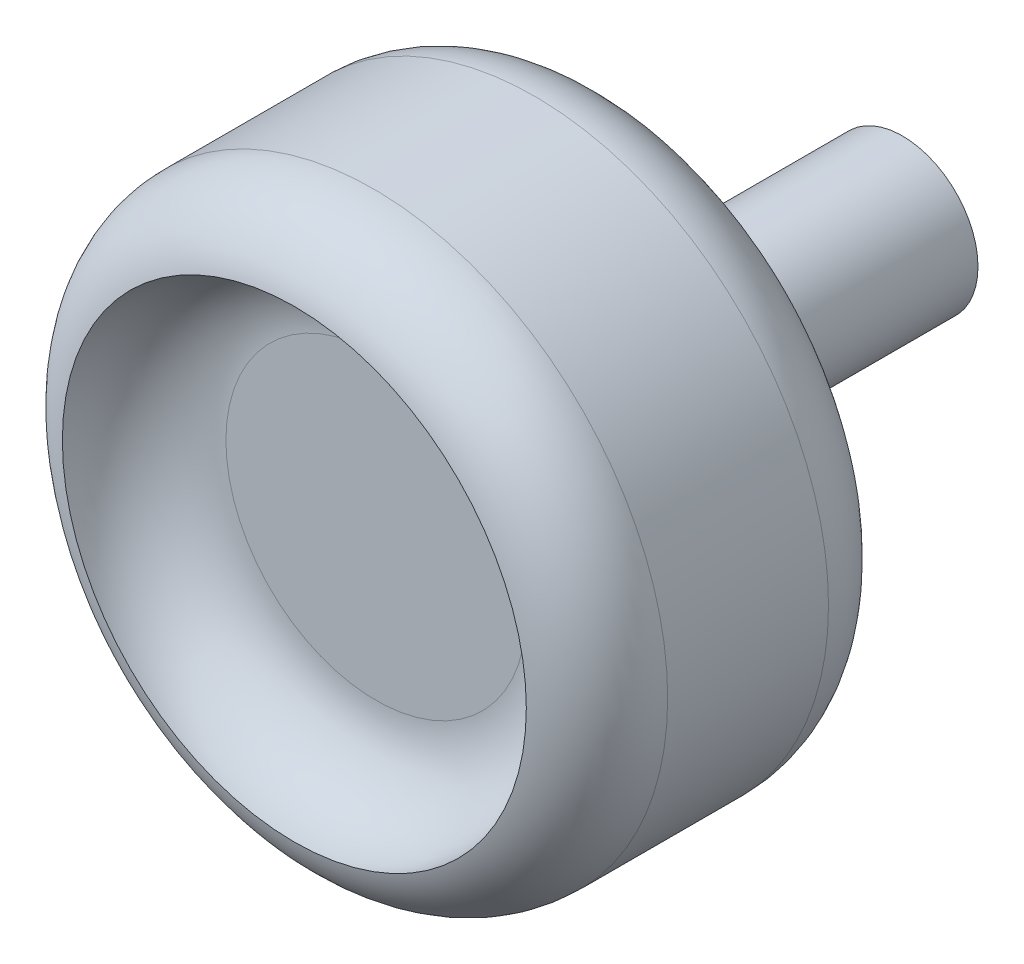
ISO-10303-21;
HEADER;
FILE_DESCRIPTION(('STEP AP214'),'2;1');
FILE_NAME('part.step','',(''),(''),'','','');
FILE_SCHEMA(('AUTOMOTIVE_DESIGN { 1 0 10303 214 1 1 1 1 }'));
ENDSEC;
DATA;
#1=APPLICATION_CONTEXT('core data for automotive mechanical design processes');
#2=APPLICATION_PROTOCOL_DEFINITION('international standard','automotive_design',2000,#1);
#3=PRODUCT_CONTEXT('',#1,'mechanical');
#4=PRODUCT('Part','Part','',(#3));
#5=PRODUCT_RELATED_PRODUCT_CATEGORY('part','',(#4));
#6=PRODUCT_DEFINITION_FORMATION('','',#4);
#7=PRODUCT_DEFINITION_CONTEXT('part definition',#1,'design');
#8=PRODUCT_DEFINITION('design','',#6,#7);
#9=PRODUCT_DEFINITION_SHAPE('','',#8);
#10=(LENGTH_UNIT() NAMED_UNIT(*) SI_UNIT(.MILLI.,.METRE.));
#11=(NAMED_UNIT(*) PLANE_ANGLE_UNIT() SI_UNIT($,.RADIAN.));
#12=(NAMED_UNIT(*) SI_UNIT($,.STERADIAN.) SOLID_ANGLE_UNIT());
#13=UNCERTAINTY_MEASURE_WITH_UNIT(LENGTH_MEASURE(1.E-05),#10,'distance_accuracy_value','');
#14=(GEOMETRIC_REPRESENTATION_CONTEXT(3) GLOBAL_UNCERTAINTY_ASSIGNED_CONTEXT((#13)) GLOBAL_UNIT_ASSIGNED_CONTEXT((#10,
#11,#12)) REPRESENTATION_CONTEXT('',''));
#15=CARTESIAN_POINT('',(0.,0.,0.));
#16=DIRECTION('',(0.,0.,1.));
#17=DIRECTION('',(1.,0.,0.));
#18=AXIS2_PLACEMENT_3D('',#15,#16,#17);
#19=CARTESIAN_POINT('',(21.7507776035779,-13.8367406859206,8.89));
#20=DIRECTION('',(0.,0.,-1.));
#21=DIRECTION('',(-1.,0.,0.));
#22=AXIS2_PLACEMENT_3D('',#19,#20,#21);
#23=CYLINDRICAL_SURFACE('',#22,2.34536814916272);
#24=CARTESIAN_POINT('',(21.7507776035779,-13.8367406859206,8.89));
#25=DIRECTION('',(0.,0.,1.));
#26=DIRECTION('',(1.,0.,0.));
#27=AXIS2_PLACEMENT_3D('',#24,#25,#26);
#28=CIRCLE('',#27,2.34536814916272);
#29=CARTESIAN_POINT('',(24.0961457527406,-13.8367406859206,8.89));
#30=VERTEX_POINT('',#29);
#31=EDGE_CURVE('E50',#30,#30,#28,.T.);
#32=ORIENTED_EDGE('',*,*,#31,.F.);
#33=EDGE_LOOP('',(#32));
#34=FACE_BOUND('',#33,.T.);
#35=CARTESIAN_POINT('',(21.7507776035779,-13.8367406859206,0.));
#36=DIRECTION('',(0.,0.,1.));
#37=DIRECTION('',(1.,0.,0.));
#38=AXIS2_PLACEMENT_3D('',#35,#36,#37);
#39=CIRCLE('',#38,2.34536814916272);
#40=CARTESIAN_POINT('',(24.0961457527406,-13.8367406859206,0.));
#41=VERTEX_POINT('',#40);
#42=EDGE_CURVE('E51',#41,#41,#39,.T.);
#43=ORIENTED_EDGE('',*,*,#42,.T.);
#44=EDGE_LOOP('',(#43));
#45=FACE_BOUND('',#44,.T.);
#46=ADVANCED_FACE('F30',(#34,#45),#23,.T.);
#47=CARTESIAN_POINT('',(21.7507776035779,-13.8367406859206,0.));
#48=DIRECTION('',(0.,0.,1.));
#49=DIRECTION('',(1.,0.,0.));
#50=AXIS2_PLACEMENT_3D('',#47,#48,#49);
#51=PLANE('',#50);
#52=ORIENTED_EDGE('',*,*,#42,.F.);
#53=EDGE_LOOP('',(#52));
#54=FACE_BOUND('',#53,.T.);
#55=ADVANCED_FACE('F72',(#54),#51,.F.);
#56=CARTESIAN_POINT('',(21.7507776035779,-13.8367406859206,18.89));
#57=DIRECTION('',(0.,0.,-1.));
#58=DIRECTION('',(-1.,0.,0.));
#59=AXIS2_PLACEMENT_3D('',#56,#57,#58);
#60=CYLINDRICAL_SURFACE('',#59,9.13163497664892);
#61=CARTESIAN_POINT('',(21.7507776035779,-13.8367406859206,11.43));
#62=DIRECTION('',(0.,0.,1.));
#63=DIRECTION('',(1.,0.,0.));
#64=AXIS2_PLACEMENT_3D('',#61,#62,#63);
#65=CIRCLE('',#64,9.13163497664892);
#66=CARTESIAN_POINT('',(30.8824125802268,-13.8367406859206,11.43));
#67=VERTEX_POINT('',#66);
#68=EDGE_CURVE('E37',#67,#67,#65,.T.);
#69=ORIENTED_EDGE('',*,*,#68,.T.);
#70=EDGE_LOOP('',(#69));
#71=FACE_BOUND('',#70,.T.);
#72=CARTESIAN_POINT('',(21.7507776035779,-13.8367406859206,16.4253302404098));
#73=DIRECTION('',(0.,0.,1.));
#74=DIRECTION('',(1.,0.,0.));
#75=AXIS2_PLACEMENT_3D('',#72,#73,#74);
#76=CIRCLE('',#75,9.13163497664892);
#77=CARTESIAN_POINT('',(30.8824125802268,-13.8367406859206,16.4253302404098));
#78=VERTEX_POINT('',#77);
#79=EDGE_CURVE('E41',#78,#78,#76,.F.);
#80=ORIENTED_EDGE('',*,*,#79,.T.);
#81=EDGE_LOOP('',(#80));
#82=FACE_BOUND('',#81,.T.);
#83=ADVANCED_FACE('F78',(#71,#82),#60,.T.);
#84=CARTESIAN_POINT('',(21.7507776035779,-13.8367406859206,8.89));
#85=DIRECTION('',(0.,0.,1.));
#86=DIRECTION('',(1.,0.,0.));
#87=AXIS2_PLACEMENT_3D('',#84,#85,#86);
#88=PLANE('',#87);
#89=CARTESIAN_POINT('',(21.7507776035779,-13.8367406859206,8.89));
#90=DIRECTION('',(0.,0.,1.));
#91=DIRECTION('',(1.,0.,0.));
#92=AXIS2_PLACEMENT_3D('',#89,#90,#91);
#93=CIRCLE('',#92,6.59163497664892);
#94=CARTESIAN_POINT('',(28.3424125802268,-13.8367406859206,8.89));
#95=VERTEX_POINT('',#94);
#96=EDGE_CURVE('E10',#95,#95,#93,.F.);
#97=ORIENTED_EDGE('',*,*,#96,.T.);
#98=EDGE_LOOP('',(#97));
#99=FACE_BOUND('',#98,.T.);
#100=ORIENTED_EDGE('',*,*,#31,.T.);
#101=EDGE_LOOP('',(#100));
#102=FACE_BOUND('',#101,.T.);
#103=ADVANCED_FACE('F90',(#99,#102),#88,.F.);
#104=CARTESIAN_POINT('',(21.7507776035779,-13.8367406859206,16.35));
#105=DIRECTION('',(0.,0.,1.));
#106=DIRECTION('',(1.,0.,0.));
#107=AXIS2_PLACEMENT_3D('',#104,#105,#106);
#108=PLANE('',#107);
#109=CARTESIAN_POINT('',(21.7507776035779,-13.8367406859206,16.35));
#110=DIRECTION('',(0.,0.,1.));
#111=DIRECTION('',(1.,0.,0.));
#112=AXIS2_PLACEMENT_3D('',#109,#110,#111);
#113=CIRCLE('',#112,4.66564065753581);
#114=CARTESIAN_POINT('',(26.4164182611137,-13.8367406859206,16.35));
#115=VERTEX_POINT('',#114);
#116=EDGE_CURVE('E45',#115,#115,#113,.T.);
#117=ORIENTED_EDGE('',*,*,#116,.T.);
#118=EDGE_LOOP('',(#117));
#119=FACE_BOUND('',#118,.T.);
#120=ADVANCED_FACE('F86',(#119),#108,.T.);
#121=CARTESIAN_POINT('',(21.7507776035779,-13.8367406859206,18.89));
#122=DIRECTION('',(0.,0.,1.));
#123=DIRECTION('',(1.,0.,0.));
#124=AXIS2_PLACEMENT_3D('',#121,#122,#123);
#125=TOROIDAL_SURFACE('',#124,4.66564065753581,2.54);
#126=CARTESIAN_POINT('',(21.7507776035779,-13.8367406859206,18.89));
#127=DIRECTION('',(0.,0.,1.));
#128=DIRECTION('',(1.,0.,0.));
#129=AXIS2_PLACEMENT_3D('',#126,#127,#128);
#130=CIRCLE('',#129,7.20564065753581);
#131=CARTESIAN_POINT('',(28.9564182611137,-13.8367406859206,18.89));
#132=VERTEX_POINT('',#131);
#133=EDGE_CURVE('E54',#132,#132,#130,.T.);
#134=ORIENTED_EDGE('',*,*,#133,.T.);
#135=EDGE_LOOP('',(#134));
#136=FACE_BOUND('',#135,.T.);
#137=ORIENTED_EDGE('',*,*,#116,.F.);
#138=EDGE_LOOP('',(#137));
#139=FACE_BOUND('',#138,.T.);
#140=ADVANCED_FACE('F60',(#136,#139),#125,.F.);
#141=CARTESIAN_POINT('',(21.7507776035779,-13.8367406859206,11.43));
#142=DIRECTION('',(0.,0.,1.));
#143=DIRECTION('',(1.,0.,0.));
#144=AXIS2_PLACEMENT_3D('',#141,#142,#143);
#145=TOROIDAL_SURFACE('',#144,6.59163497664892,2.54);
#146=ORIENTED_EDGE('',*,*,#96,.F.);
#147=EDGE_LOOP('',(#146));
#148=FACE_BOUND('',#147,.T.);
#149=ORIENTED_EDGE('',*,*,#68,.F.);
#150=EDGE_LOOP('',(#149));
#151=FACE_BOUND('',#150,.T.);
#152=ADVANCED_FACE('F64',(#148,#151),#145,.T.);
#153=CARTESIAN_POINT('',(21.7507776035779,-13.8367406859206,16.4253302404098));
#154=DIRECTION('',(0.,0.,1.));
#155=DIRECTION('',(1.,0.,0.));
#156=AXIS2_PLACEMENT_3D('',#153,#154,#155);
#157=TOROIDAL_SURFACE('',#156,6.59163497664892,2.54);
#158=ORIENTED_EDGE('',*,*,#79,.F.);
#159=EDGE_LOOP('',(#158));
#160=FACE_BOUND('',#159,.T.);
#161=ORIENTED_EDGE('',*,*,#133,.F.);
#162=EDGE_LOOP('',(#161));
#163=FACE_BOUND('',#162,.T.);
#164=ADVANCED_FACE('F32',(#160,#163),#157,.T.);
#165=CLOSED_SHELL('',(#46,#55,#83,#103,#120,#140,#152,#164));
#166=MANIFOLD_SOLID_BREP('B2',#165);
#167=ADVANCED_BREP_SHAPE_REPRESENTATION('',(#18,#166),#14);
#168=SHAPE_DEFINITION_REPRESENTATION(#9,#167);
ENDSEC;
END-ISO-10303-21;
